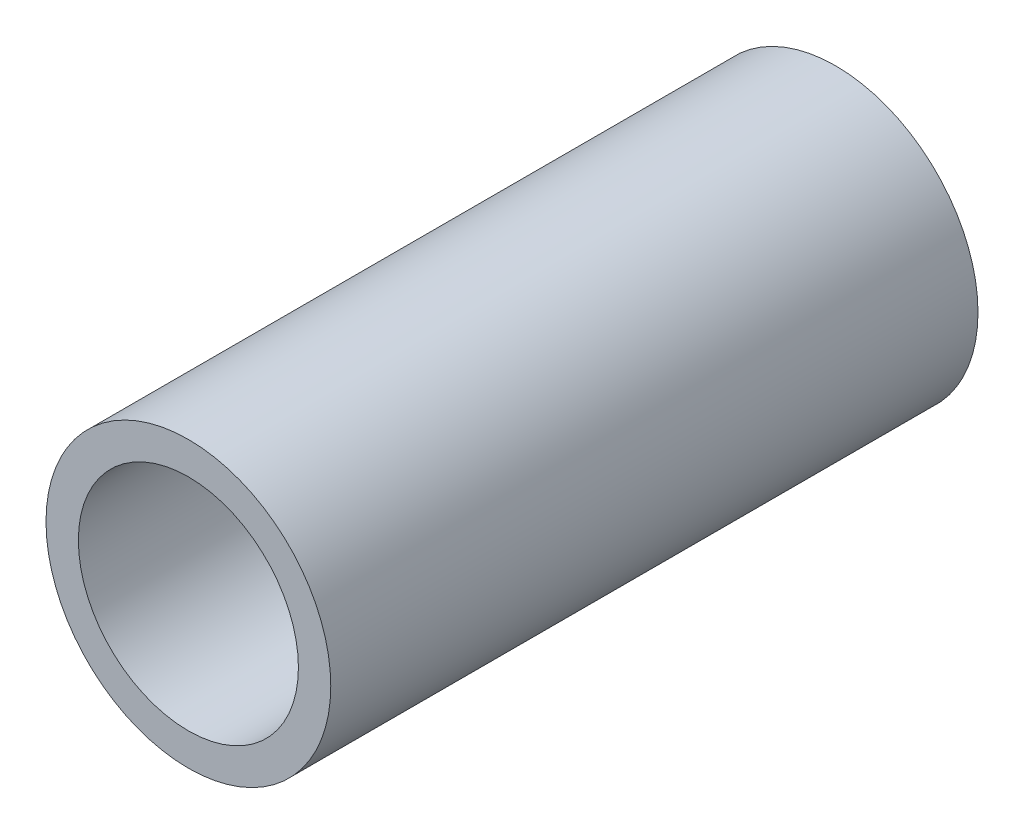
ISO-10303-21;
HEADER;
FILE_DESCRIPTION(('STEP AP214'),'2;1');
FILE_NAME('part.step','',(''),(''),'','','');
FILE_SCHEMA(('AUTOMOTIVE_DESIGN { 1 0 10303 214 1 1 1 1 }'));
ENDSEC;
DATA;
#1=APPLICATION_CONTEXT('core data for automotive mechanical design processes');
#2=APPLICATION_PROTOCOL_DEFINITION('international standard','automotive_design',2000,#1);
#3=PRODUCT_CONTEXT('',#1,'mechanical');
#4=PRODUCT('Part','Part','',(#3));
#5=PRODUCT_RELATED_PRODUCT_CATEGORY('part','',(#4));
#6=PRODUCT_DEFINITION_FORMATION('','',#4);
#7=PRODUCT_DEFINITION_CONTEXT('part definition',#1,'design');
#8=PRODUCT_DEFINITION('design','',#6,#7);
#9=PRODUCT_DEFINITION_SHAPE('','',#8);
#10=(LENGTH_UNIT() NAMED_UNIT(*) SI_UNIT(.MILLI.,.METRE.));
#11=(NAMED_UNIT(*) PLANE_ANGLE_UNIT() SI_UNIT($,.RADIAN.));
#12=(NAMED_UNIT(*) SI_UNIT($,.STERADIAN.) SOLID_ANGLE_UNIT());
#13=UNCERTAINTY_MEASURE_WITH_UNIT(LENGTH_MEASURE(1.E-05),#10,'distance_accuracy_value','');
#14=(GEOMETRIC_REPRESENTATION_CONTEXT(3) GLOBAL_UNCERTAINTY_ASSIGNED_CONTEXT((#13)) GLOBAL_UNIT_ASSIGNED_CONTEXT((#10,
#11,#12)) REPRESENTATION_CONTEXT('',''));
#15=CARTESIAN_POINT('',(0.,0.,0.));
#16=DIRECTION('',(0.,0.,1.));
#17=DIRECTION('',(1.,0.,0.));
#18=AXIS2_PLACEMENT_3D('',#15,#16,#17);
#19=CARTESIAN_POINT('',(0.,0.,10.));
#20=DIRECTION('',(0.,0.,1.));
#21=DIRECTION('',(1.,0.,0.));
#22=AXIS2_PLACEMENT_3D('',#19,#20,#21);
#23=PLANE('',#22);
#24=CARTESIAN_POINT('',(0.,0.,10.));
#25=DIRECTION('',(0.,0.,1.));
#26=DIRECTION('',(1.,0.,0.));
#27=AXIS2_PLACEMENT_3D('',#24,#25,#26);
#28=CIRCLE('',#27,2.2);
#29=CARTESIAN_POINT('',(2.2,0.,10.));
#30=VERTEX_POINT('',#29);
#31=EDGE_CURVE('E10',#30,#30,#28,.T.);
#32=ORIENTED_EDGE('',*,*,#31,.T.);
#33=EDGE_LOOP('',(#32));
#34=FACE_BOUND('',#33,.T.);
#35=CARTESIAN_POINT('',(0.,0.,10.));
#36=DIRECTION('',(0.,0.,1.));
#37=DIRECTION('',(1.,0.,0.));
#38=AXIS2_PLACEMENT_3D('',#35,#36,#37);
#39=CIRCLE('',#38,1.7);
#40=CARTESIAN_POINT('',(1.7,0.,10.));
#41=VERTEX_POINT('',#40);
#42=EDGE_CURVE('E41',#41,#41,#39,.T.);
#43=ORIENTED_EDGE('',*,*,#42,.F.);
#44=EDGE_LOOP('',(#43));
#45=FACE_BOUND('',#44,.T.);
#46=ADVANCED_FACE('F30',(#34,#45),#23,.T.);
#47=CARTESIAN_POINT('',(0.,0.,0.));
#48=DIRECTION('',(0.,0.,1.));
#49=DIRECTION('',(1.,0.,0.));
#50=AXIS2_PLACEMENT_3D('',#47,#48,#49);
#51=PLANE('',#50);
#52=CARTESIAN_POINT('',(0.,0.,0.));
#53=DIRECTION('',(0.,0.,1.));
#54=DIRECTION('',(1.,0.,0.));
#55=AXIS2_PLACEMENT_3D('',#52,#53,#54);
#56=CIRCLE('',#55,2.2);
#57=CARTESIAN_POINT('',(2.2,0.,0.));
#58=VERTEX_POINT('',#57);
#59=EDGE_CURVE('E34',#58,#58,#56,.T.);
#60=ORIENTED_EDGE('',*,*,#59,.F.);
#61=EDGE_LOOP('',(#60));
#62=FACE_BOUND('',#61,.T.);
#63=CARTESIAN_POINT('',(0.,0.,0.));
#64=DIRECTION('',(0.,0.,1.));
#65=DIRECTION('',(1.,0.,0.));
#66=AXIS2_PLACEMENT_3D('',#63,#64,#65);
#67=CIRCLE('',#66,1.7);
#68=CARTESIAN_POINT('',(1.7,0.,0.));
#69=VERTEX_POINT('',#68);
#70=EDGE_CURVE('E43',#69,#69,#67,.T.);
#71=ORIENTED_EDGE('',*,*,#70,.T.);
#72=EDGE_LOOP('',(#71));
#73=FACE_BOUND('',#72,.T.);
#74=ADVANCED_FACE('F53',(#62,#73),#51,.F.);
#75=CARTESIAN_POINT('',(0.,0.,10.));
#76=DIRECTION('',(0.,0.,-1.));
#77=DIRECTION('',(-1.,0.,0.));
#78=AXIS2_PLACEMENT_3D('',#75,#76,#77);
#79=CYLINDRICAL_SURFACE('',#78,2.2);
#80=ORIENTED_EDGE('',*,*,#31,.F.);
#81=EDGE_LOOP('',(#80));
#82=FACE_BOUND('',#81,.T.);
#83=ORIENTED_EDGE('',*,*,#59,.T.);
#84=EDGE_LOOP('',(#83));
#85=FACE_BOUND('',#84,.T.);
#86=ADVANCED_FACE('F32',(#82,#85),#79,.T.);
#87=CARTESIAN_POINT('',(0.,0.,10.));
#88=DIRECTION('',(0.,0.,-1.));
#89=DIRECTION('',(-1.,0.,0.));
#90=AXIS2_PLACEMENT_3D('',#87,#88,#89);
#91=CYLINDRICAL_SURFACE('',#90,1.7);
#92=ORIENTED_EDGE('',*,*,#42,.T.);
#93=EDGE_LOOP('',(#92));
#94=FACE_BOUND('',#93,.T.);
#95=ORIENTED_EDGE('',*,*,#70,.F.);
#96=EDGE_LOOP('',(#95));
#97=FACE_BOUND('',#96,.T.);
#98=ADVANCED_FACE('F49',(#94,#97),#91,.F.);
#99=CLOSED_SHELL('',(#46,#74,#86,#98));
#100=MANIFOLD_SOLID_BREP('B2',#99);
#101=ADVANCED_BREP_SHAPE_REPRESENTATION('',(#18,#100),#14);
#102=SHAPE_DEFINITION_REPRESENTATION(#9,#101);
ENDSEC;
END-ISO-10303-21;
